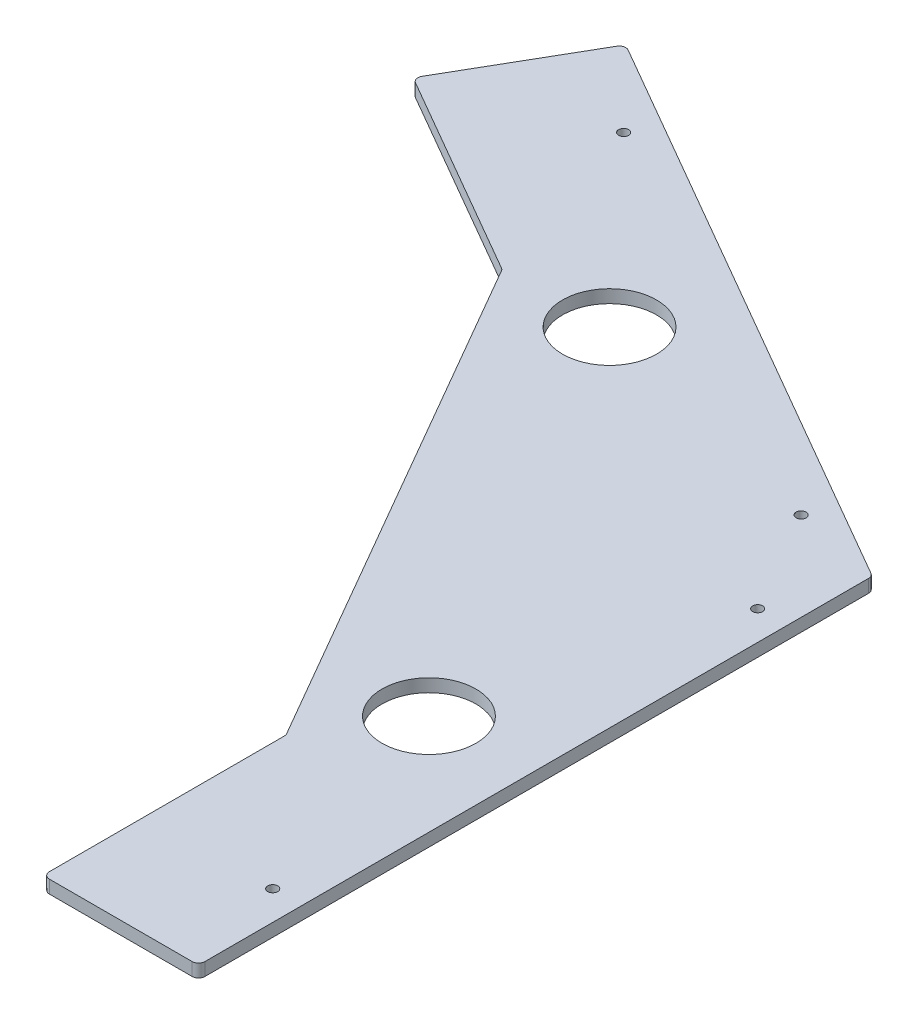
ISO-10303-21;
HEADER;
FILE_DESCRIPTION(('STEP AP214'),'2;1');
FILE_NAME('part.step','',(''),(''),'','','');
FILE_SCHEMA(('AUTOMOTIVE_DESIGN { 1 0 10303 214 1 1 1 1 }'));
ENDSEC;
DATA;
#1=APPLICATION_CONTEXT('core data for automotive mechanical design processes');
#2=APPLICATION_PROTOCOL_DEFINITION('international standard','automotive_design',2000,#1);
#3=PRODUCT_CONTEXT('',#1,'mechanical');
#4=PRODUCT('Part','Part','',(#3));
#5=PRODUCT_RELATED_PRODUCT_CATEGORY('part','',(#4));
#6=PRODUCT_DEFINITION_FORMATION('','',#4);
#7=PRODUCT_DEFINITION_CONTEXT('part definition',#1,'design');
#8=PRODUCT_DEFINITION('design','',#6,#7);
#9=PRODUCT_DEFINITION_SHAPE('','',#8);
#10=(LENGTH_UNIT() NAMED_UNIT(*) SI_UNIT(.MILLI.,.METRE.));
#11=(NAMED_UNIT(*) PLANE_ANGLE_UNIT() SI_UNIT($,.RADIAN.));
#12=(NAMED_UNIT(*) SI_UNIT($,.STERADIAN.) SOLID_ANGLE_UNIT());
#13=UNCERTAINTY_MEASURE_WITH_UNIT(LENGTH_MEASURE(1.E-05),#10,'distance_accuracy_value','');
#14=(GEOMETRIC_REPRESENTATION_CONTEXT(3) GLOBAL_UNCERTAINTY_ASSIGNED_CONTEXT((#13)) GLOBAL_UNIT_ASSIGNED_CONTEXT((#10,
#11,#12)) REPRESENTATION_CONTEXT('',''));
#15=CARTESIAN_POINT('',(0.,0.,0.));
#16=DIRECTION('',(0.,0.,1.));
#17=DIRECTION('',(1.,0.,0.));
#18=AXIS2_PLACEMENT_3D('',#15,#16,#17);
#19=CARTESIAN_POINT('',(0.,6.35,0.));
#20=DIRECTION('',(0.,1.,0.));
#21=DIRECTION('',(0.,0.,1.));
#22=AXIS2_PLACEMENT_3D('',#19,#20,#21);
#23=PLANE('',#22);
#24=CARTESIAN_POINT('',(-43.4068750823877,6.35,-338.518865913276));
#25=DIRECTION('',(0.,1.,0.));
#26=DIRECTION('',(0.,0.,1.));
#27=AXIS2_PLACEMENT_3D('',#24,#25,#26);
#28=CIRCLE('',#27,2.45744999999987);
#29=CARTESIAN_POINT('',(-43.4068750823877,6.35,-336.061415913276));
#30=VERTEX_POINT('',#29);
#31=EDGE_CURVE('E294',#30,#30,#28,.T.);
#32=ORIENTED_EDGE('',*,*,#31,.F.);
#33=EDGE_LOOP('',(#32));
#34=FACE_BOUND('',#33,.T.);
#35=CARTESIAN_POINT('',(-49.2124999999999,6.35,-162.061031219973));
#36=DIRECTION('',(0.,1.,0.));
#37=DIRECTION('',(0.,0.,1.));
#38=AXIS2_PLACEMENT_3D('',#35,#36,#37);
#39=CIRCLE('',#38,23.0187499999997);
#40=CARTESIAN_POINT('',(-49.2124999999999,6.35,-139.042281219974));
#41=VERTEX_POINT('',#40);
#42=EDGE_CURVE('E282',#41,#41,#39,.T.);
#43=ORIENTED_EDGE('',*,*,#42,.F.);
#44=EDGE_LOOP('',(#43));
#45=FACE_BOUND('',#44,.T.);
#46=CARTESIAN_POINT('',(-14.2874999999997,6.35,-50.6078687859258));
#47=DIRECTION('',(0.,1.,0.));
#48=DIRECTION('',(0.,0.,1.));
#49=AXIS2_PLACEMENT_3D('',#46,#47,#48);
#50=CIRCLE('',#49,2.45744999999931);
#51=CARTESIAN_POINT('',(-14.2874999999997,6.35,-48.1504187859265));
#52=VERTEX_POINT('',#51);
#53=EDGE_CURVE('E253',#52,#52,#50,.T.);
#54=ORIENTED_EDGE('',*,*,#53,.F.);
#55=EDGE_LOOP('',(#54));
#56=FACE_BOUND('',#55,.T.);
#57=DIRECTION('',(-0.499999999999996,0.,0.866025403784441));
#58=VECTOR('',#57,1.);
#59=CARTESIAN_POINT('',(-285.750000000001,6.35,-494.933518262806));
#60=LINE('',#59,#58);
#61=CARTESIAN_POINT('',(-287.337500000001,6.35,-492.183887605791));
#62=VERTEX_POINT('',#61);
#63=CARTESIAN_POINT('',(-322.2625,6.35,-431.692013151448));
#64=VERTEX_POINT('',#63);
#65=EDGE_CURVE('E245',#62,#64,#60,.T.);
#66=ORIENTED_EDGE('',*,*,#65,.T.);
#67=CARTESIAN_POINT('',(-319.512869342985,6.35,-430.104513151448));
#68=DIRECTION('',(0.,1.,0.));
#69=DIRECTION('',(0.,0.,1.));
#70=AXIS2_PLACEMENT_3D('',#67,#68,#69);
#71=CIRCLE('',#70,3.175);
#72=CARTESIAN_POINT('',(-321.100369342985,6.35,-427.354882494432));
#73=VERTEX_POINT('',#72);
#74=EDGE_CURVE('E208',#64,#73,#71,.T.);
#75=ORIENTED_EDGE('',*,*,#74,.T.);
#76=DIRECTION('',(0.86602540378444,0.,0.499999999999998));
#77=VECTOR('',#76,1.);
#78=CARTESIAN_POINT('',(-323.85,6.35,-428.942382494432));
#79=LINE('',#78,#77);
#80=CARTESIAN_POINT('',(-221.496872271715,6.35,-369.848776648106));
#81=VERTEX_POINT('',#80);
#82=EDGE_CURVE('E240',#73,#81,#79,.T.);
#83=ORIENTED_EDGE('',*,*,#82,.T.);
#84=CARTESIAN_POINT('',(-223.084372271715,6.35,-367.099145991091));
#85=DIRECTION('',(0.,1.,0.));
#86=DIRECTION('',(0.,0.,1.));
#87=AXIS2_PLACEMENT_3D('',#84,#85,#86);
#88=CIRCLE('',#87,3.175);
#89=CARTESIAN_POINT('',(-220.334741614699,6.35,-368.686645991091));
#90=VERTEX_POINT('',#89);
#91=EDGE_CURVE('E11',#81,#90,#88,.F.);
#92=ORIENTED_EDGE('',*,*,#91,.T.);
#93=DIRECTION('',(0.500000000000001,0.,0.866025403784438));
#94=VECTOR('',#93,1.);
#95=CARTESIAN_POINT('',(-220.760110957684,6.35,-369.423407305122));
#96=LINE('',#95,#94);
#97=CARTESIAN_POINT('',(-76.6253693429844,6.35,-119.774711692651));
#98=VERTEX_POINT('',#97);
#99=EDGE_CURVE('E239',#90,#98,#96,.T.);
#100=ORIENTED_EDGE('',*,*,#99,.T.);
#101=CARTESIAN_POINT('',(-79.375,6.35,-118.187211692651));
#102=DIRECTION('',(0.,1.,0.));
#103=DIRECTION('',(0.,0.,1.));
#104=AXIS2_PLACEMENT_3D('',#101,#102,#103);
#105=CIRCLE('',#104,3.175);
#106=CARTESIAN_POINT('',(-76.2,6.35,-118.187211692651));
#107=VERTEX_POINT('',#106);
#108=EDGE_CURVE('E149',#98,#107,#105,.F.);
#109=ORIENTED_EDGE('',*,*,#108,.T.);
#110=DIRECTION('',(0.,0.,1.));
#111=VECTOR('',#110,1.);
#112=CARTESIAN_POINT('',(-76.2,6.35,-119.03795037862));
#113=LINE('',#112,#111);
#114=CARTESIAN_POINT('',(-76.2,6.35,-3.175));
#115=VERTEX_POINT('',#114);
#116=EDGE_CURVE('E159',#107,#115,#113,.T.);
#117=ORIENTED_EDGE('',*,*,#116,.T.);
#118=CARTESIAN_POINT('',(-73.025,6.35,-3.175));
#119=DIRECTION('',(0.,1.,0.));
#120=DIRECTION('',(0.,0.,1.));
#121=AXIS2_PLACEMENT_3D('',#118,#119,#120);
#122=CIRCLE('',#121,3.175);
#123=CARTESIAN_POINT('',(-73.025,6.35,0.));
#124=VERTEX_POINT('',#123);
#125=EDGE_CURVE('E201',#115,#124,#122,.T.);
#126=ORIENTED_EDGE('',*,*,#125,.T.);
#127=DIRECTION('',(1.,0.,0.));
#128=VECTOR('',#127,1.);
#129=CARTESIAN_POINT('',(-76.2,6.35,0.));
#130=LINE('',#129,#128);
#131=CARTESIAN_POINT('',(-3.17500000000003,6.35,0.));
#132=VERTEX_POINT('',#131);
#133=EDGE_CURVE('E168',#124,#132,#130,.T.);
#134=ORIENTED_EDGE('',*,*,#133,.T.);
#135=CARTESIAN_POINT('',(-3.175,6.35,-3.175));
#136=DIRECTION('',(0.,1.,0.));
#137=DIRECTION('',(0.,0.,1.));
#138=AXIS2_PLACEMENT_3D('',#135,#136,#137);
#139=CIRCLE('',#138,3.175);
#140=CARTESIAN_POINT('',(0.,6.35,-3.175));
#141=VERTEX_POINT('',#140);
#142=EDGE_CURVE('E203',#132,#141,#139,.T.);
#143=ORIENTED_EDGE('',*,*,#142,.T.);
#144=DIRECTION('',(0.,0.,-1.));
#145=VECTOR('',#144,1.);
#146=CARTESIAN_POINT('',(0.,6.35,0.));
#147=LINE('',#146,#145);
#148=CARTESIAN_POINT('',(0.,6.35,-328.122591737194));
#149=VERTEX_POINT('',#148);
#150=EDGE_CURVE('E172',#141,#149,#147,.T.);
#151=ORIENTED_EDGE('',*,*,#150,.T.);
#152=CARTESIAN_POINT('',(-3.175,6.35,-328.122591737194));
#153=DIRECTION('',(0.,1.,0.));
#154=DIRECTION('',(0.,0.,1.));
#155=AXIS2_PLACEMENT_3D('',#152,#153,#154);
#156=CIRCLE('',#155,3.175);
#157=CARTESIAN_POINT('',(-1.58750000000003,6.35,-330.87222239421));
#158=VERTEX_POINT('',#157);
#159=EDGE_CURVE('E59',#149,#158,#156,.T.);
#160=ORIENTED_EDGE('',*,*,#159,.T.);
#161=DIRECTION('',(-0.86602540378444,0.,-0.499999999999998));
#162=VECTOR('',#161,1.);
#163=CARTESIAN_POINT('',(0.,6.35,-329.955678841871));
#164=LINE('',#163,#162);
#165=CARTESIAN_POINT('',(-283.000369342985,6.35,-493.346018262806));
#166=VERTEX_POINT('',#165);
#167=EDGE_CURVE('E269',#158,#166,#164,.T.);
#168=ORIENTED_EDGE('',*,*,#167,.T.);
#169=CARTESIAN_POINT('',(-284.587869342985,6.35,-490.596387605791));
#170=DIRECTION('',(0.,1.,0.));
#171=DIRECTION('',(0.,0.,1.));
#172=AXIS2_PLACEMENT_3D('',#169,#170,#171);
#173=CIRCLE('',#172,3.175);
#174=EDGE_CURVE('E206',#166,#62,#173,.T.);
#175=ORIENTED_EDGE('',*,*,#174,.T.);
#176=EDGE_LOOP('',(#66,#75,#83,#92,#100,#109,#117,#126,#134,#143,#151,#160,#168,#175));
#177=FACE_BOUND('',#176,.T.);
#178=CARTESIAN_POINT('',(-14.2875,6.35,-288.082628785925));
#179=DIRECTION('',(0.,1.,0.));
#180=DIRECTION('',(0.,0.,1.));
#181=AXIS2_PLACEMENT_3D('',#178,#179,#180);
#182=CIRCLE('',#181,2.45744999999968);
#183=CARTESIAN_POINT('',(-14.2875,6.35,-285.625178785926));
#184=VERTEX_POINT('',#183);
#185=EDGE_CURVE('E276',#184,#184,#182,.T.);
#186=ORIENTED_EDGE('',*,*,#185,.F.);
#187=EDGE_LOOP('',(#186));
#188=FACE_BOUND('',#187,.T.);
#189=CARTESIAN_POINT('',(-170.00728,6.35,-371.283727469078));
#190=DIRECTION('',(0.,1.,0.));
#191=DIRECTION('',(0.,0.,1.));
#192=AXIS2_PLACEMENT_3D('',#189,#190,#191);
#193=CIRCLE('',#192,23.01875);
#194=CARTESIAN_POINT('',(-170.00728,6.35,-348.264977469078));
#195=VERTEX_POINT('',#194);
#196=EDGE_CURVE('E288',#195,#195,#193,.T.);
#197=ORIENTED_EDGE('',*,*,#196,.F.);
#198=EDGE_LOOP('',(#197));
#199=FACE_BOUND('',#198,.T.);
#200=CARTESIAN_POINT('',(-249.066050000001,6.35,-457.256245913275));
#201=DIRECTION('',(0.,1.,0.));
#202=DIRECTION('',(0.,0.,1.));
#203=AXIS2_PLACEMENT_3D('',#200,#201,#202);
#204=CIRCLE('',#203,2.45745000000076);
#205=CARTESIAN_POINT('',(-249.066050000001,6.35,-454.798795913274));
#206=VERTEX_POINT('',#205);
#207=EDGE_CURVE('E300',#206,#206,#204,.T.);
#208=ORIENTED_EDGE('',*,*,#207,.F.);
#209=EDGE_LOOP('',(#208));
#210=FACE_BOUND('',#209,.T.);
#211=ADVANCED_FACE('F37',(#34,#45,#56,#177,#188,#199,#210),#23,.T.);
#212=CARTESIAN_POINT('',(0.,0.,0.));
#213=DIRECTION('',(0.,1.,0.));
#214=DIRECTION('',(0.,0.,1.));
#215=AXIS2_PLACEMENT_3D('',#212,#213,#214);
#216=PLANE('',#215);
#217=DIRECTION('',(0.86602540378444,0.,0.499999999999998));
#218=VECTOR('',#217,1.);
#219=CARTESIAN_POINT('',(-323.85,0.,-428.942382494432));
#220=LINE('',#219,#218);
#221=CARTESIAN_POINT('',(-321.100369342985,0.,-427.354882494432));
#222=VERTEX_POINT('',#221);
#223=CARTESIAN_POINT('',(-221.496872271715,0.,-369.848776648106));
#224=VERTEX_POINT('',#223);
#225=EDGE_CURVE('E174',#222,#224,#220,.T.);
#226=ORIENTED_EDGE('',*,*,#225,.F.);
#227=CARTESIAN_POINT('',(-319.512869342985,0.,-430.104513151448));
#228=DIRECTION('',(0.,1.,0.));
#229=DIRECTION('',(0.,0.,1.));
#230=AXIS2_PLACEMENT_3D('',#227,#228,#229);
#231=CIRCLE('',#230,3.175);
#232=CARTESIAN_POINT('',(-322.2625,0.,-431.692013151448));
#233=VERTEX_POINT('',#232);
#234=EDGE_CURVE('E194',#222,#233,#231,.F.);
#235=ORIENTED_EDGE('',*,*,#234,.T.);
#236=DIRECTION('',(-0.499999999999996,0.,0.866025403784441));
#237=VECTOR('',#236,1.);
#238=CARTESIAN_POINT('',(-285.750000000001,0.,-494.933518262806));
#239=LINE('',#238,#237);
#240=CARTESIAN_POINT('',(-287.337500000001,0.,-492.183887605791));
#241=VERTEX_POINT('',#240);
#242=EDGE_CURVE('E232',#241,#233,#239,.T.);
#243=ORIENTED_EDGE('',*,*,#242,.F.);
#244=CARTESIAN_POINT('',(-284.587869342985,0.,-490.596387605791));
#245=DIRECTION('',(0.,1.,0.));
#246=DIRECTION('',(0.,0.,1.));
#247=AXIS2_PLACEMENT_3D('',#244,#245,#246);
#248=CIRCLE('',#247,3.175);
#249=CARTESIAN_POINT('',(-283.000369342985,0.,-493.346018262806));
#250=VERTEX_POINT('',#249);
#251=EDGE_CURVE('E192',#241,#250,#248,.F.);
#252=ORIENTED_EDGE('',*,*,#251,.T.);
#253=DIRECTION('',(-0.86602540378444,0.,-0.499999999999998));
#254=VECTOR('',#253,1.);
#255=CARTESIAN_POINT('',(0.,0.,-329.955678841871));
#256=LINE('',#255,#254);
#257=CARTESIAN_POINT('',(-1.58750000000003,0.,-330.87222239421));
#258=VERTEX_POINT('',#257);
#259=EDGE_CURVE('E256',#258,#250,#256,.T.);
#260=ORIENTED_EDGE('',*,*,#259,.F.);
#261=CARTESIAN_POINT('',(-3.175,0.,-328.122591737194));
#262=DIRECTION('',(0.,1.,0.));
#263=DIRECTION('',(0.,0.,1.));
#264=AXIS2_PLACEMENT_3D('',#261,#262,#263);
#265=CIRCLE('',#264,3.175);
#266=CARTESIAN_POINT('',(0.,0.,-328.122591737194));
#267=VERTEX_POINT('',#266);
#268=EDGE_CURVE('E190',#258,#267,#265,.F.);
#269=ORIENTED_EDGE('',*,*,#268,.T.);
#270=DIRECTION('',(0.,0.,-1.));
#271=VECTOR('',#270,1.);
#272=CARTESIAN_POINT('',(0.,0.,0.));
#273=LINE('',#272,#271);
#274=CARTESIAN_POINT('',(0.,0.,-3.175));
#275=VERTEX_POINT('',#274);
#276=EDGE_CURVE('E252',#275,#267,#273,.T.);
#277=ORIENTED_EDGE('',*,*,#276,.F.);
#278=CARTESIAN_POINT('',(-3.175,0.,-3.175));
#279=DIRECTION('',(0.,1.,0.));
#280=DIRECTION('',(0.,0.,1.));
#281=AXIS2_PLACEMENT_3D('',#278,#279,#280);
#282=CIRCLE('',#281,3.175);
#283=CARTESIAN_POINT('',(-3.17500000000003,0.,0.));
#284=VERTEX_POINT('',#283);
#285=EDGE_CURVE('E188',#275,#284,#282,.F.);
#286=ORIENTED_EDGE('',*,*,#285,.T.);
#287=DIRECTION('',(1.,0.,0.));
#288=VECTOR('',#287,1.);
#289=CARTESIAN_POINT('',(-76.2,0.,0.));
#290=LINE('',#289,#288);
#291=CARTESIAN_POINT('',(-73.025,0.,0.));
#292=VERTEX_POINT('',#291);
#293=EDGE_CURVE('E249',#292,#284,#290,.T.);
#294=ORIENTED_EDGE('',*,*,#293,.F.);
#295=CARTESIAN_POINT('',(-73.025,0.,-3.175));
#296=DIRECTION('',(0.,1.,0.));
#297=DIRECTION('',(0.,0.,1.));
#298=AXIS2_PLACEMENT_3D('',#295,#296,#297);
#299=CIRCLE('',#298,3.175);
#300=CARTESIAN_POINT('',(-76.2,0.,-3.175));
#301=VERTEX_POINT('',#300);
#302=EDGE_CURVE('E167',#292,#301,#299,.F.);
#303=ORIENTED_EDGE('',*,*,#302,.T.);
#304=DIRECTION('',(0.,0.,1.));
#305=VECTOR('',#304,1.);
#306=CARTESIAN_POINT('',(-76.2,0.,-119.03795037862));
#307=LINE('',#306,#305);
#308=CARTESIAN_POINT('',(-76.2,0.,-118.187211692651));
#309=VERTEX_POINT('',#308);
#310=EDGE_CURVE('E156',#309,#301,#307,.T.);
#311=ORIENTED_EDGE('',*,*,#310,.F.);
#312=CARTESIAN_POINT('',(-79.375,0.,-118.187211692651));
#313=DIRECTION('',(0.,1.,0.));
#314=DIRECTION('',(0.,0.,1.));
#315=AXIS2_PLACEMENT_3D('',#312,#313,#314);
#316=CIRCLE('',#315,3.175);
#317=CARTESIAN_POINT('',(-76.6253693429844,0.,-119.774711692651));
#318=VERTEX_POINT('',#317);
#319=EDGE_CURVE('E139',#309,#318,#316,.T.);
#320=ORIENTED_EDGE('',*,*,#319,.T.);
#321=DIRECTION('',(0.500000000000001,0.,0.866025403784438));
#322=VECTOR('',#321,1.);
#323=CARTESIAN_POINT('',(-220.760110957684,0.,-369.423407305122));
#324=LINE('',#323,#322);
#325=CARTESIAN_POINT('',(-220.334741614699,0.,-368.686645991091));
#326=VERTEX_POINT('',#325);
#327=EDGE_CURVE('E169',#326,#318,#324,.T.);
#328=ORIENTED_EDGE('',*,*,#327,.F.);
#329=CARTESIAN_POINT('',(-223.084372271715,0.,-367.099145991091));
#330=DIRECTION('',(0.,1.,0.));
#331=DIRECTION('',(0.,0.,1.));
#332=AXIS2_PLACEMENT_3D('',#329,#330,#331);
#333=CIRCLE('',#332,3.175);
#334=EDGE_CURVE('E45',#326,#224,#333,.T.);
#335=ORIENTED_EDGE('',*,*,#334,.T.);
#336=EDGE_LOOP('',(#226,#235,#243,#252,#260,#269,#277,#286,#294,#303,#311,#320,#328,#335));
#337=FACE_BOUND('',#336,.T.);
#338=CARTESIAN_POINT('',(-14.2874999999997,0.,-50.6078687859258));
#339=DIRECTION('',(0.,1.,0.));
#340=DIRECTION('',(0.,0.,1.));
#341=AXIS2_PLACEMENT_3D('',#338,#339,#340);
#342=CIRCLE('',#341,2.45744999999931);
#343=CARTESIAN_POINT('',(-14.2874999999997,0.,-48.1504187859265));
#344=VERTEX_POINT('',#343);
#345=EDGE_CURVE('E273',#344,#344,#342,.T.);
#346=ORIENTED_EDGE('',*,*,#345,.T.);
#347=EDGE_LOOP('',(#346));
#348=FACE_BOUND('',#347,.T.);
#349=CARTESIAN_POINT('',(-14.2875,0.,-288.082628785925));
#350=DIRECTION('',(0.,1.,0.));
#351=DIRECTION('',(0.,0.,1.));
#352=AXIS2_PLACEMENT_3D('',#349,#350,#351);
#353=CIRCLE('',#352,2.45744999999968);
#354=CARTESIAN_POINT('',(-14.2875,0.,-285.625178785926));
#355=VERTEX_POINT('',#354);
#356=EDGE_CURVE('E279',#355,#355,#353,.T.);
#357=ORIENTED_EDGE('',*,*,#356,.T.);
#358=EDGE_LOOP('',(#357));
#359=FACE_BOUND('',#358,.T.);
#360=CARTESIAN_POINT('',(-49.2124999999999,0.,-162.061031219973));
#361=DIRECTION('',(0.,1.,0.));
#362=DIRECTION('',(0.,0.,1.));
#363=AXIS2_PLACEMENT_3D('',#360,#361,#362);
#364=CIRCLE('',#363,23.0187499999997);
#365=CARTESIAN_POINT('',(-49.2124999999999,0.,-139.042281219974));
#366=VERTEX_POINT('',#365);
#367=EDGE_CURVE('E285',#366,#366,#364,.T.);
#368=ORIENTED_EDGE('',*,*,#367,.T.);
#369=EDGE_LOOP('',(#368));
#370=FACE_BOUND('',#369,.T.);
#371=CARTESIAN_POINT('',(-170.00728,0.,-371.283727469078));
#372=DIRECTION('',(0.,1.,0.));
#373=DIRECTION('',(0.,0.,1.));
#374=AXIS2_PLACEMENT_3D('',#371,#372,#373);
#375=CIRCLE('',#374,23.01875);
#376=CARTESIAN_POINT('',(-170.00728,0.,-348.264977469078));
#377=VERTEX_POINT('',#376);
#378=EDGE_CURVE('E291',#377,#377,#375,.T.);
#379=ORIENTED_EDGE('',*,*,#378,.T.);
#380=EDGE_LOOP('',(#379));
#381=FACE_BOUND('',#380,.T.);
#382=CARTESIAN_POINT('',(-43.4068750823877,0.,-338.518865913276));
#383=DIRECTION('',(0.,1.,0.));
#384=DIRECTION('',(0.,0.,1.));
#385=AXIS2_PLACEMENT_3D('',#382,#383,#384);
#386=CIRCLE('',#385,2.45744999999987);
#387=CARTESIAN_POINT('',(-43.4068750823877,0.,-336.061415913276));
#388=VERTEX_POINT('',#387);
#389=EDGE_CURVE('E297',#388,#388,#386,.T.);
#390=ORIENTED_EDGE('',*,*,#389,.T.);
#391=EDGE_LOOP('',(#390));
#392=FACE_BOUND('',#391,.T.);
#393=CARTESIAN_POINT('',(-249.066050000001,0.,-457.256245913275));
#394=DIRECTION('',(0.,1.,0.));
#395=DIRECTION('',(0.,0.,1.));
#396=AXIS2_PLACEMENT_3D('',#393,#394,#395);
#397=CIRCLE('',#396,2.45745000000076);
#398=CARTESIAN_POINT('',(-249.066050000001,0.,-454.798795913274));
#399=VERTEX_POINT('',#398);
#400=EDGE_CURVE('E303',#399,#399,#397,.T.);
#401=ORIENTED_EDGE('',*,*,#400,.T.);
#402=EDGE_LOOP('',(#401));
#403=FACE_BOUND('',#402,.T.);
#404=ADVANCED_FACE('F164',(#337,#348,#359,#370,#381,#392,#403),#216,.F.);
#405=CARTESIAN_POINT('',(-76.2,6.35,0.));
#406=DIRECTION('',(0.,0.,-1.));
#407=DIRECTION('',(-1.,0.,0.));
#408=AXIS2_PLACEMENT_3D('',#405,#406,#407);
#409=PLANE('',#408);
#410=ORIENTED_EDGE('',*,*,#293,.T.);
#411=DIRECTION('',(0.,-1.,0.));
#412=VECTOR('',#411,1.);
#413=CARTESIAN_POINT('',(-3.175,6.35,0.));
#414=LINE('',#413,#412);
#415=EDGE_CURVE('E150',#284,#132,#414,.F.);
#416=ORIENTED_EDGE('',*,*,#415,.T.);
#417=ORIENTED_EDGE('',*,*,#133,.F.);
#418=DIRECTION('',(0.,-1.,0.));
#419=VECTOR('',#418,1.);
#420=CARTESIAN_POINT('',(-73.025,6.35,0.));
#421=LINE('',#420,#419);
#422=EDGE_CURVE('E219',#124,#292,#421,.T.);
#423=ORIENTED_EDGE('',*,*,#422,.T.);
#424=EDGE_LOOP('',(#410,#416,#417,#423));
#425=FACE_BOUND('',#424,.T.);
#426=ADVANCED_FACE('F319',(#425),#409,.F.);
#427=CARTESIAN_POINT('',(0.,6.35,0.));
#428=DIRECTION('',(-1.,0.,0.));
#429=DIRECTION('',(0.,0.,1.));
#430=AXIS2_PLACEMENT_3D('',#427,#428,#429);
#431=PLANE('',#430);
#432=ORIENTED_EDGE('',*,*,#276,.T.);
#433=DIRECTION('',(0.,-1.,0.));
#434=VECTOR('',#433,1.);
#435=CARTESIAN_POINT('',(0.,6.35,-328.122591737194));
#436=LINE('',#435,#434);
#437=EDGE_CURVE('E217',#267,#149,#436,.F.);
#438=ORIENTED_EDGE('',*,*,#437,.T.);
#439=ORIENTED_EDGE('',*,*,#150,.F.);
#440=DIRECTION('',(0.,-1.,0.));
#441=VECTOR('',#440,1.);
#442=CARTESIAN_POINT('',(0.,6.35,-3.175));
#443=LINE('',#442,#441);
#444=EDGE_CURVE('E214',#141,#275,#443,.T.);
#445=ORIENTED_EDGE('',*,*,#444,.T.);
#446=EDGE_LOOP('',(#432,#438,#439,#445));
#447=FACE_BOUND('',#446,.T.);
#448=ADVANCED_FACE('F338',(#447),#431,.F.);
#449=CARTESIAN_POINT('',(0.,6.35,-329.955678841871));
#450=DIRECTION('',(-0.499999999999998,0.,0.86602540378444));
#451=DIRECTION('',(0.86602540378444,0.,0.499999999999998));
#452=AXIS2_PLACEMENT_3D('',#449,#450,#451);
#453=PLANE('',#452);
#454=ORIENTED_EDGE('',*,*,#259,.T.);
#455=DIRECTION('',(0.,-1.,0.));
#456=VECTOR('',#455,1.);
#457=CARTESIAN_POINT('',(-283.000369342985,6.35,-493.346018262806));
#458=LINE('',#457,#456);
#459=EDGE_CURVE('E52',#250,#166,#458,.F.);
#460=ORIENTED_EDGE('',*,*,#459,.T.);
#461=ORIENTED_EDGE('',*,*,#167,.F.);
#462=DIRECTION('',(0.,-1.,0.));
#463=VECTOR('',#462,1.);
#464=CARTESIAN_POINT('',(-1.58750000000002,6.35,-330.87222239421));
#465=LINE('',#464,#463);
#466=EDGE_CURVE('E210',#158,#258,#465,.T.);
#467=ORIENTED_EDGE('',*,*,#466,.T.);
#468=EDGE_LOOP('',(#454,#460,#461,#467));
#469=FACE_BOUND('',#468,.T.);
#470=ADVANCED_FACE('F335',(#469),#453,.F.);
#471=CARTESIAN_POINT('',(-285.750000000001,6.35,-494.933518262806));
#472=DIRECTION('',(0.866025403784441,0.,0.499999999999996));
#473=DIRECTION('',(0.499999999999996,0.,-0.866025403784441));
#474=AXIS2_PLACEMENT_3D('',#471,#472,#473);
#475=PLANE('',#474);
#476=ORIENTED_EDGE('',*,*,#242,.T.);
#477=DIRECTION('',(0.,-1.,0.));
#478=VECTOR('',#477,1.);
#479=CARTESIAN_POINT('',(-322.2625,6.35,-431.692013151448));
#480=LINE('',#479,#478);
#481=EDGE_CURVE('E199',#233,#64,#480,.F.);
#482=ORIENTED_EDGE('',*,*,#481,.T.);
#483=ORIENTED_EDGE('',*,*,#65,.F.);
#484=DIRECTION('',(0.,-1.,0.));
#485=VECTOR('',#484,1.);
#486=CARTESIAN_POINT('',(-287.337500000001,6.35,-492.183887605791));
#487=LINE('',#486,#485);
#488=EDGE_CURVE('E196',#62,#241,#487,.T.);
#489=ORIENTED_EDGE('',*,*,#488,.T.);
#490=EDGE_LOOP('',(#476,#482,#483,#489));
#491=FACE_BOUND('',#490,.T.);
#492=ADVANCED_FACE('F262',(#491),#475,.F.);
#493=CARTESIAN_POINT('',(-323.85,6.35,-428.942382494432));
#494=DIRECTION('',(0.499999999999998,0.,-0.86602540378444));
#495=DIRECTION('',(-0.86602540378444,0.,-0.499999999999998));
#496=AXIS2_PLACEMENT_3D('',#493,#494,#495);
#497=PLANE('',#496);
#498=ORIENTED_EDGE('',*,*,#225,.T.);
#499=DIRECTION('',(0.,-1.,0.));
#500=VECTOR('',#499,1.);
#501=CARTESIAN_POINT('',(-221.496872271715,6.35,-369.848776648106));
#502=LINE('',#501,#500);
#503=EDGE_CURVE('E185',#224,#81,#502,.F.);
#504=ORIENTED_EDGE('',*,*,#503,.T.);
#505=ORIENTED_EDGE('',*,*,#82,.F.);
#506=DIRECTION('',(0.,-1.,0.));
#507=VECTOR('',#506,1.);
#508=CARTESIAN_POINT('',(-321.100369342985,6.35,-427.354882494432));
#509=LINE('',#508,#507);
#510=EDGE_CURVE('E182',#73,#222,#509,.T.);
#511=ORIENTED_EDGE('',*,*,#510,.T.);
#512=EDGE_LOOP('',(#498,#504,#505,#511));
#513=FACE_BOUND('',#512,.T.);
#514=ADVANCED_FACE('F228',(#513),#497,.F.);
#515=CARTESIAN_POINT('',(-220.760110957684,6.35,-369.423407305122));
#516=DIRECTION('',(0.866025403784438,0.,-0.500000000000001));
#517=DIRECTION('',(-0.500000000000001,0.,-0.866025403784438));
#518=AXIS2_PLACEMENT_3D('',#515,#516,#517);
#519=PLANE('',#518);
#520=ORIENTED_EDGE('',*,*,#327,.T.);
#521=DIRECTION('',(0.,-1.,0.));
#522=VECTOR('',#521,1.);
#523=CARTESIAN_POINT('',(-76.6253693429844,6.35,-119.774711692651));
#524=LINE('',#523,#522);
#525=EDGE_CURVE('E144',#318,#98,#524,.F.);
#526=ORIENTED_EDGE('',*,*,#525,.T.);
#527=ORIENTED_EDGE('',*,*,#99,.F.);
#528=DIRECTION('',(0.,-1.,0.));
#529=VECTOR('',#528,1.);
#530=CARTESIAN_POINT('',(-220.334741614699,0.,-368.686645991091));
#531=LINE('',#530,#529);
#532=EDGE_CURVE('E160',#90,#326,#531,.T.);
#533=ORIENTED_EDGE('',*,*,#532,.T.);
#534=EDGE_LOOP('',(#520,#526,#527,#533));
#535=FACE_BOUND('',#534,.T.);
#536=ADVANCED_FACE('F242',(#535),#519,.F.);
#537=CARTESIAN_POINT('',(-76.2,6.35,-119.03795037862));
#538=DIRECTION('',(1.,0.,0.));
#539=DIRECTION('',(0.,0.,-1.));
#540=AXIS2_PLACEMENT_3D('',#537,#538,#539);
#541=PLANE('',#540);
#542=ORIENTED_EDGE('',*,*,#116,.F.);
#543=DIRECTION('',(0.,-1.,0.));
#544=VECTOR('',#543,1.);
#545=CARTESIAN_POINT('',(-76.2,0.,-118.187211692651));
#546=LINE('',#545,#544);
#547=EDGE_CURVE('E143',#107,#309,#546,.T.);
#548=ORIENTED_EDGE('',*,*,#547,.T.);
#549=ORIENTED_EDGE('',*,*,#310,.T.);
#550=DIRECTION('',(0.,-1.,0.));
#551=VECTOR('',#550,1.);
#552=CARTESIAN_POINT('',(-76.2,6.35,-3.175));
#553=LINE('',#552,#551);
#554=EDGE_CURVE('E161',#301,#115,#553,.F.);
#555=ORIENTED_EDGE('',*,*,#554,.T.);
#556=EDGE_LOOP('',(#542,#548,#549,#555));
#557=FACE_BOUND('',#556,.T.);
#558=ADVANCED_FACE('F155',(#557),#541,.F.);
#559=CARTESIAN_POINT('',(-14.2874999999997,6.35,-50.6078687859258));
#560=DIRECTION('',(0.,-1.,0.));
#561=DIRECTION('',(0.,0.,-1.));
#562=AXIS2_PLACEMENT_3D('',#559,#560,#561);
#563=CYLINDRICAL_SURFACE('',#562,2.45744999999931);
#564=ORIENTED_EDGE('',*,*,#53,.T.);
#565=EDGE_LOOP('',(#564));
#566=FACE_BOUND('',#565,.T.);
#567=ORIENTED_EDGE('',*,*,#345,.F.);
#568=EDGE_LOOP('',(#567));
#569=FACE_BOUND('',#568,.T.);
#570=ADVANCED_FACE('F324',(#566,#569),#563,.F.);
#571=CARTESIAN_POINT('',(-14.2875,6.35,-288.082628785925));
#572=DIRECTION('',(0.,-1.,0.));
#573=DIRECTION('',(0.,0.,-1.));
#574=AXIS2_PLACEMENT_3D('',#571,#572,#573);
#575=CYLINDRICAL_SURFACE('',#574,2.45744999999968);
#576=ORIENTED_EDGE('',*,*,#185,.T.);
#577=EDGE_LOOP('',(#576));
#578=FACE_BOUND('',#577,.T.);
#579=ORIENTED_EDGE('',*,*,#356,.F.);
#580=EDGE_LOOP('',(#579));
#581=FACE_BOUND('',#580,.T.);
#582=ADVANCED_FACE('F429',(#578,#581),#575,.F.);
#583=CARTESIAN_POINT('',(-49.2124999999999,6.35,-162.061031219973));
#584=DIRECTION('',(0.,-1.,0.));
#585=DIRECTION('',(0.,0.,-1.));
#586=AXIS2_PLACEMENT_3D('',#583,#584,#585);
#587=CYLINDRICAL_SURFACE('',#586,23.0187499999997);
#588=ORIENTED_EDGE('',*,*,#42,.T.);
#589=EDGE_LOOP('',(#588));
#590=FACE_BOUND('',#589,.T.);
#591=ORIENTED_EDGE('',*,*,#367,.F.);
#592=EDGE_LOOP('',(#591));
#593=FACE_BOUND('',#592,.T.);
#594=ADVANCED_FACE('F421',(#590,#593),#587,.F.);
#595=CARTESIAN_POINT('',(-170.00728,6.35,-371.283727469078));
#596=DIRECTION('',(0.,-1.,0.));
#597=DIRECTION('',(0.,0.,-1.));
#598=AXIS2_PLACEMENT_3D('',#595,#596,#597);
#599=CYLINDRICAL_SURFACE('',#598,23.01875);
#600=ORIENTED_EDGE('',*,*,#196,.T.);
#601=EDGE_LOOP('',(#600));
#602=FACE_BOUND('',#601,.T.);
#603=ORIENTED_EDGE('',*,*,#378,.F.);
#604=EDGE_LOOP('',(#603));
#605=FACE_BOUND('',#604,.T.);
#606=ADVANCED_FACE('F413',(#602,#605),#599,.F.);
#607=CARTESIAN_POINT('',(-43.4068750823877,6.35,-338.518865913276));
#608=DIRECTION('',(0.,-1.,0.));
#609=DIRECTION('',(0.,0.,-1.));
#610=AXIS2_PLACEMENT_3D('',#607,#608,#609);
#611=CYLINDRICAL_SURFACE('',#610,2.45744999999987);
#612=ORIENTED_EDGE('',*,*,#31,.T.);
#613=EDGE_LOOP('',(#612));
#614=FACE_BOUND('',#613,.T.);
#615=ORIENTED_EDGE('',*,*,#389,.F.);
#616=EDGE_LOOP('',(#615));
#617=FACE_BOUND('',#616,.T.);
#618=ADVANCED_FACE('F406',(#614,#617),#611,.F.);
#619=CARTESIAN_POINT('',(-249.066050000001,6.35,-457.256245913275));
#620=DIRECTION('',(0.,-1.,0.));
#621=DIRECTION('',(0.,0.,-1.));
#622=AXIS2_PLACEMENT_3D('',#619,#620,#621);
#623=CYLINDRICAL_SURFACE('',#622,2.45745000000076);
#624=ORIENTED_EDGE('',*,*,#207,.T.);
#625=EDGE_LOOP('',(#624));
#626=FACE_BOUND('',#625,.T.);
#627=ORIENTED_EDGE('',*,*,#400,.F.);
#628=EDGE_LOOP('',(#627));
#629=FACE_BOUND('',#628,.T.);
#630=ADVANCED_FACE('F309',(#626,#629),#623,.F.);
#631=CARTESIAN_POINT('',(-79.375,6.35,-118.187211692651));
#632=DIRECTION('',(0.,1.,0.));
#633=DIRECTION('',(0.,0.,1.));
#634=AXIS2_PLACEMENT_3D('',#631,#632,#633);
#635=CYLINDRICAL_SURFACE('',#634,3.175);
#636=ORIENTED_EDGE('',*,*,#108,.F.);
#637=ORIENTED_EDGE('',*,*,#525,.F.);
#638=ORIENTED_EDGE('',*,*,#319,.F.);
#639=ORIENTED_EDGE('',*,*,#547,.F.);
#640=EDGE_LOOP('',(#636,#637,#638,#639));
#641=FACE_BOUND('',#640,.T.);
#642=ADVANCED_FACE('F142',(#641),#635,.F.);
#643=CARTESIAN_POINT('',(-223.084372271715,6.35,-367.099145991091));
#644=DIRECTION('',(0.,1.,0.));
#645=DIRECTION('',(0.,0.,1.));
#646=AXIS2_PLACEMENT_3D('',#643,#644,#645);
#647=CYLINDRICAL_SURFACE('',#646,3.175);
#648=ORIENTED_EDGE('',*,*,#91,.F.);
#649=ORIENTED_EDGE('',*,*,#503,.F.);
#650=ORIENTED_EDGE('',*,*,#334,.F.);
#651=ORIENTED_EDGE('',*,*,#532,.F.);
#652=EDGE_LOOP('',(#648,#649,#650,#651));
#653=FACE_BOUND('',#652,.T.);
#654=ADVANCED_FACE('F234',(#653),#647,.F.);
#655=CARTESIAN_POINT('',(-319.512869342985,6.35,-430.104513151448));
#656=DIRECTION('',(0.,-1.,0.));
#657=DIRECTION('',(0.,0.,-1.));
#658=AXIS2_PLACEMENT_3D('',#655,#656,#657);
#659=CYLINDRICAL_SURFACE('',#658,3.175);
#660=ORIENTED_EDGE('',*,*,#74,.F.);
#661=ORIENTED_EDGE('',*,*,#481,.F.);
#662=ORIENTED_EDGE('',*,*,#234,.F.);
#663=ORIENTED_EDGE('',*,*,#510,.F.);
#664=EDGE_LOOP('',(#660,#661,#662,#663));
#665=FACE_BOUND('',#664,.T.);
#666=ADVANCED_FACE('F267',(#665),#659,.T.);
#667=CARTESIAN_POINT('',(-284.587869342985,6.35,-490.596387605791));
#668=DIRECTION('',(0.,-1.,0.));
#669=DIRECTION('',(0.,0.,-1.));
#670=AXIS2_PLACEMENT_3D('',#667,#668,#669);
#671=CYLINDRICAL_SURFACE('',#670,3.175);
#672=ORIENTED_EDGE('',*,*,#174,.F.);
#673=ORIENTED_EDGE('',*,*,#459,.F.);
#674=ORIENTED_EDGE('',*,*,#251,.F.);
#675=ORIENTED_EDGE('',*,*,#488,.F.);
#676=EDGE_LOOP('',(#672,#673,#674,#675));
#677=FACE_BOUND('',#676,.T.);
#678=ADVANCED_FACE('F351',(#677),#671,.T.);
#679=CARTESIAN_POINT('',(-3.175,6.35,-328.122591737194));
#680=DIRECTION('',(0.,-1.,0.));
#681=DIRECTION('',(0.,0.,-1.));
#682=AXIS2_PLACEMENT_3D('',#679,#680,#681);
#683=CYLINDRICAL_SURFACE('',#682,3.175);
#684=ORIENTED_EDGE('',*,*,#159,.F.);
#685=ORIENTED_EDGE('',*,*,#437,.F.);
#686=ORIENTED_EDGE('',*,*,#268,.F.);
#687=ORIENTED_EDGE('',*,*,#466,.F.);
#688=EDGE_LOOP('',(#684,#685,#686,#687));
#689=FACE_BOUND('',#688,.T.);
#690=ADVANCED_FACE('F354',(#689),#683,.T.);
#691=CARTESIAN_POINT('',(-3.175,6.35,-3.175));
#692=DIRECTION('',(0.,-1.,0.));
#693=DIRECTION('',(0.,0.,-1.));
#694=AXIS2_PLACEMENT_3D('',#691,#692,#693);
#695=CYLINDRICAL_SURFACE('',#694,3.175);
#696=ORIENTED_EDGE('',*,*,#142,.F.);
#697=ORIENTED_EDGE('',*,*,#415,.F.);
#698=ORIENTED_EDGE('',*,*,#285,.F.);
#699=ORIENTED_EDGE('',*,*,#444,.F.);
#700=EDGE_LOOP('',(#696,#697,#698,#699));
#701=FACE_BOUND('',#700,.T.);
#702=ADVANCED_FACE('F357',(#701),#695,.T.);
#703=CARTESIAN_POINT('',(-73.025,6.35,-3.175));
#704=DIRECTION('',(0.,-1.,0.));
#705=DIRECTION('',(0.,0.,-1.));
#706=AXIS2_PLACEMENT_3D('',#703,#704,#705);
#707=CYLINDRICAL_SURFACE('',#706,3.175);
#708=ORIENTED_EDGE('',*,*,#125,.F.);
#709=ORIENTED_EDGE('',*,*,#554,.F.);
#710=ORIENTED_EDGE('',*,*,#302,.F.);
#711=ORIENTED_EDGE('',*,*,#422,.F.);
#712=EDGE_LOOP('',(#708,#709,#710,#711));
#713=FACE_BOUND('',#712,.T.);
#714=ADVANCED_FACE('F39',(#713),#707,.T.);
#715=CLOSED_SHELL('',(#211,#404,#426,#448,#470,#492,#514,#536,#558,#570,#582,#594,#606,#618,
#630,#642,#654,#666,#678,#690,#702,#714));
#716=MANIFOLD_SOLID_BREP('B2',#715);
#717=ADVANCED_BREP_SHAPE_REPRESENTATION('',(#18,#716),#14);
#718=SHAPE_DEFINITION_REPRESENTATION(#9,#717);
ENDSEC;
END-ISO-10303-21;
